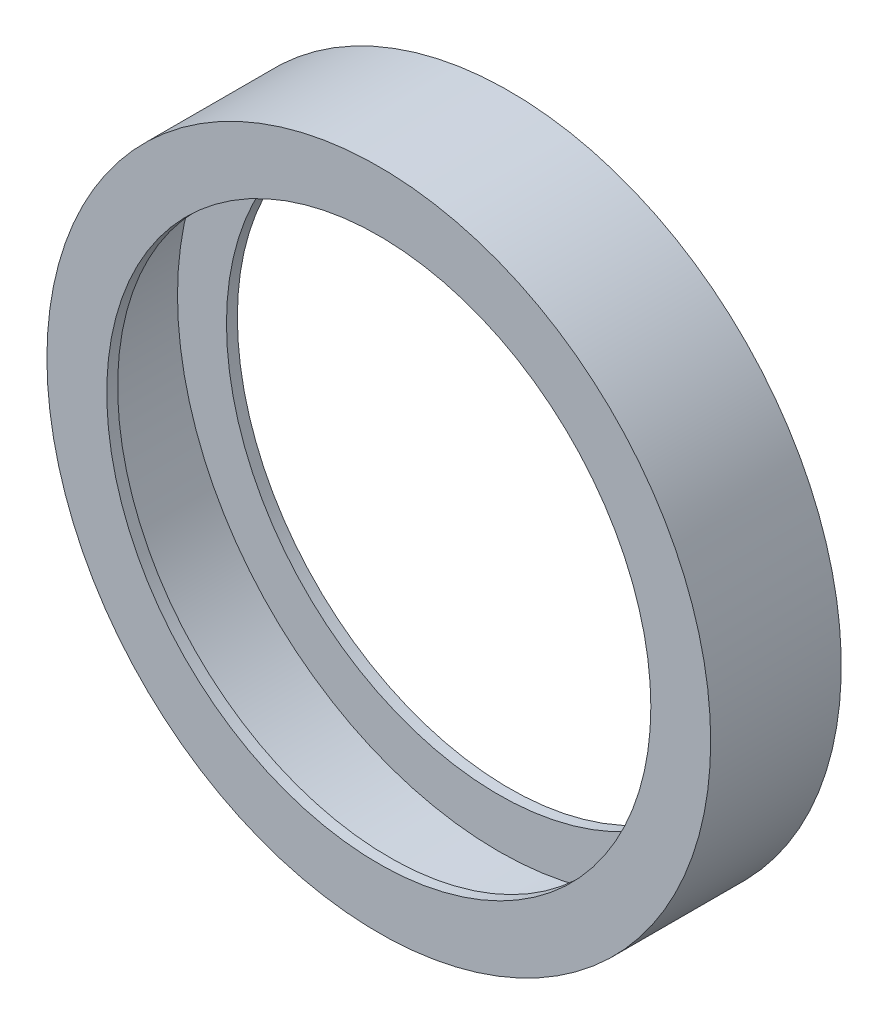
ISO-10303-21;
HEADER;
FILE_DESCRIPTION(('STEP AP214'),'2;1');
FILE_NAME('part.step','',(''),(''),'','','');
FILE_SCHEMA(('AUTOMOTIVE_DESIGN { 1 0 10303 214 1 1 1 1 }'));
ENDSEC;
DATA;
#1=APPLICATION_CONTEXT('core data for automotive mechanical design processes');
#2=APPLICATION_PROTOCOL_DEFINITION('international standard','automotive_design',2000,#1);
#3=PRODUCT_CONTEXT('',#1,'mechanical');
#4=PRODUCT('Part','Part','',(#3));
#5=PRODUCT_RELATED_PRODUCT_CATEGORY('part','',(#4));
#6=PRODUCT_DEFINITION_FORMATION('','',#4);
#7=PRODUCT_DEFINITION_CONTEXT('part definition',#1,'design');
#8=PRODUCT_DEFINITION('design','',#6,#7);
#9=PRODUCT_DEFINITION_SHAPE('','',#8);
#10=(LENGTH_UNIT() NAMED_UNIT(*) SI_UNIT(.MILLI.,.METRE.));
#11=(NAMED_UNIT(*) PLANE_ANGLE_UNIT() SI_UNIT($,.RADIAN.));
#12=(NAMED_UNIT(*) SI_UNIT($,.STERADIAN.) SOLID_ANGLE_UNIT());
#13=UNCERTAINTY_MEASURE_WITH_UNIT(LENGTH_MEASURE(1.E-05),#10,'distance_accuracy_value','');
#14=(GEOMETRIC_REPRESENTATION_CONTEXT(3) GLOBAL_UNCERTAINTY_ASSIGNED_CONTEXT((#13)) GLOBAL_UNIT_ASSIGNED_CONTEXT((#10,
#11,#12)) REPRESENTATION_CONTEXT('',''));
#15=CARTESIAN_POINT('',(0.,0.,0.));
#16=DIRECTION('',(0.,0.,1.));
#17=DIRECTION('',(1.,0.,0.));
#18=AXIS2_PLACEMENT_3D('',#15,#16,#17);
#19=CARTESIAN_POINT('',(0.,0.,0.));
#20=DIRECTION('',(0.,0.,1.));
#21=DIRECTION('',(1.,0.,0.));
#22=AXIS2_PLACEMENT_3D('',#19,#20,#21);
#23=PLANE('',#22);
#24=CARTESIAN_POINT('',(0.,0.,0.));
#25=DIRECTION('',(0.,0.,1.));
#26=DIRECTION('',(1.,0.,0.));
#27=AXIS2_PLACEMENT_3D('',#24,#25,#26);
#28=CIRCLE('',#27,25.);
#29=CARTESIAN_POINT('',(25.,0.,0.));
#30=VERTEX_POINT('',#29);
#31=EDGE_CURVE('E42',#30,#30,#28,.T.);
#32=ORIENTED_EDGE('',*,*,#31,.T.);
#33=EDGE_LOOP('',(#32));
#34=FACE_BOUND('',#33,.T.);
#35=CARTESIAN_POINT('',(0.,0.,0.));
#36=DIRECTION('',(0.,0.,-1.));
#37=DIRECTION('',(-1.,0.,0.));
#38=AXIS2_PLACEMENT_3D('',#35,#36,#37);
#39=CIRCLE('',#38,29.5);
#40=CARTESIAN_POINT('',(-29.5,0.,0.));
#41=VERTEX_POINT('',#40);
#42=EDGE_CURVE('E47',#41,#41,#39,.T.);
#43=ORIENTED_EDGE('',*,*,#42,.T.);
#44=EDGE_LOOP('',(#43));
#45=FACE_BOUND('',#44,.T.);
#46=ADVANCED_FACE('F31',(#34,#45),#23,.F.);
#47=CARTESIAN_POINT('',(0.,0.,1.));
#48=DIRECTION('',(0.,0.,1.));
#49=DIRECTION('',(1.,0.,0.));
#50=AXIS2_PLACEMENT_3D('',#47,#48,#49);
#51=PLANE('',#50);
#52=CARTESIAN_POINT('',(0.,0.,1.));
#53=DIRECTION('',(0.,0.,1.));
#54=DIRECTION('',(1.,0.,0.));
#55=AXIS2_PLACEMENT_3D('',#52,#53,#54);
#56=CIRCLE('',#55,30.5);
#57=CARTESIAN_POINT('',(30.5,0.,1.));
#58=VERTEX_POINT('',#57);
#59=EDGE_CURVE('E10',#58,#58,#56,.T.);
#60=ORIENTED_EDGE('',*,*,#59,.T.);
#61=EDGE_LOOP('',(#60));
#62=FACE_BOUND('',#61,.T.);
#63=CARTESIAN_POINT('',(0.,0.,1.));
#64=DIRECTION('',(0.,0.,1.));
#65=DIRECTION('',(1.,0.,0.));
#66=AXIS2_PLACEMENT_3D('',#63,#64,#65);
#67=CIRCLE('',#66,25.);
#68=CARTESIAN_POINT('',(25.,0.,1.));
#69=VERTEX_POINT('',#68);
#70=EDGE_CURVE('E38',#69,#69,#67,.T.);
#71=ORIENTED_EDGE('',*,*,#70,.F.);
#72=EDGE_LOOP('',(#71));
#73=FACE_BOUND('',#72,.T.);
#74=ADVANCED_FACE('F81',(#62,#73),#51,.T.);
#75=CARTESIAN_POINT('',(0.,0.,1.));
#76=DIRECTION('',(0.,0.,-1.));
#77=DIRECTION('',(-1.,0.,0.));
#78=AXIS2_PLACEMENT_3D('',#75,#76,#77);
#79=CYLINDRICAL_SURFACE('',#78,30.5);
#80=ORIENTED_EDGE('',*,*,#59,.F.);
#81=EDGE_LOOP('',(#80));
#82=FACE_BOUND('',#81,.T.);
#83=CARTESIAN_POINT('',(0.,0.,-11.));
#84=DIRECTION('',(0.,0.,-1.));
#85=DIRECTION('',(-1.,0.,0.));
#86=AXIS2_PLACEMENT_3D('',#83,#84,#85);
#87=CIRCLE('',#86,30.5);
#88=CARTESIAN_POINT('',(-30.5,0.,-11.));
#89=VERTEX_POINT('',#88);
#90=EDGE_CURVE('E54',#89,#89,#87,.T.);
#91=ORIENTED_EDGE('',*,*,#90,.F.);
#92=EDGE_LOOP('',(#91));
#93=FACE_BOUND('',#92,.T.);
#94=ADVANCED_FACE('F33',(#82,#93),#79,.T.);
#95=CARTESIAN_POINT('',(0.,0.,1.));
#96=DIRECTION('',(0.,0.,-1.));
#97=DIRECTION('',(-1.,0.,0.));
#98=AXIS2_PLACEMENT_3D('',#95,#96,#97);
#99=CYLINDRICAL_SURFACE('',#98,25.);
#100=ORIENTED_EDGE('',*,*,#70,.T.);
#101=EDGE_LOOP('',(#100));
#102=FACE_BOUND('',#101,.T.);
#103=ORIENTED_EDGE('',*,*,#31,.F.);
#104=EDGE_LOOP('',(#103));
#105=FACE_BOUND('',#104,.T.);
#106=ADVANCED_FACE('F89',(#102,#105),#99,.F.);
#107=CARTESIAN_POINT('',(0.,0.,-10.));
#108=DIRECTION('',(0.,0.,1.));
#109=DIRECTION('',(1.,0.,0.));
#110=AXIS2_PLACEMENT_3D('',#107,#108,#109);
#111=CYLINDRICAL_SURFACE('',#110,29.5);
#112=CARTESIAN_POINT('',(0.,0.,-10.));
#113=DIRECTION('',(0.,0.,-1.));
#114=DIRECTION('',(-1.,0.,0.));
#115=AXIS2_PLACEMENT_3D('',#112,#113,#114);
#116=CIRCLE('',#115,29.5);
#117=CARTESIAN_POINT('',(-29.5,0.,-10.));
#118=VERTEX_POINT('',#117);
#119=EDGE_CURVE('E51',#118,#118,#116,.T.);
#120=ORIENTED_EDGE('',*,*,#119,.T.);
#121=EDGE_LOOP('',(#120));
#122=FACE_BOUND('',#121,.T.);
#123=ORIENTED_EDGE('',*,*,#42,.F.);
#124=EDGE_LOOP('',(#123));
#125=FACE_BOUND('',#124,.T.);
#126=ADVANCED_FACE('F77',(#122,#125),#111,.F.);
#127=CARTESIAN_POINT('',(0.,0.,-10.));
#128=DIRECTION('',(0.,0.,-1.));
#129=DIRECTION('',(-1.,0.,0.));
#130=AXIS2_PLACEMENT_3D('',#127,#128,#129);
#131=PLANE('',#130);
#132=CARTESIAN_POINT('',(0.,0.,-10.));
#133=DIRECTION('',(0.,0.,-1.));
#134=DIRECTION('',(-1.,0.,0.));
#135=AXIS2_PLACEMENT_3D('',#132,#133,#134);
#136=CIRCLE('',#135,25.);
#137=CARTESIAN_POINT('',(-25.,0.,-10.));
#138=VERTEX_POINT('',#137);
#139=EDGE_CURVE('E58',#138,#138,#136,.T.);
#140=ORIENTED_EDGE('',*,*,#139,.T.);
#141=EDGE_LOOP('',(#140));
#142=FACE_BOUND('',#141,.T.);
#143=ORIENTED_EDGE('',*,*,#119,.F.);
#144=EDGE_LOOP('',(#143));
#145=FACE_BOUND('',#144,.T.);
#146=ADVANCED_FACE('F69',(#142,#145),#131,.F.);
#147=CARTESIAN_POINT('',(0.,0.,-11.));
#148=DIRECTION('',(0.,0.,-1.));
#149=DIRECTION('',(-1.,0.,0.));
#150=AXIS2_PLACEMENT_3D('',#147,#148,#149);
#151=PLANE('',#150);
#152=ORIENTED_EDGE('',*,*,#90,.T.);
#153=EDGE_LOOP('',(#152));
#154=FACE_BOUND('',#153,.T.);
#155=CARTESIAN_POINT('',(0.,0.,-11.));
#156=DIRECTION('',(0.,0.,-1.));
#157=DIRECTION('',(-1.,0.,0.));
#158=AXIS2_PLACEMENT_3D('',#155,#156,#157);
#159=CIRCLE('',#158,25.);
#160=CARTESIAN_POINT('',(-25.,0.,-11.));
#161=VERTEX_POINT('',#160);
#162=EDGE_CURVE('E57',#161,#161,#159,.T.);
#163=ORIENTED_EDGE('',*,*,#162,.F.);
#164=EDGE_LOOP('',(#163));
#165=FACE_BOUND('',#164,.T.);
#166=ADVANCED_FACE('F67',(#154,#165),#151,.T.);
#167=CARTESIAN_POINT('',(0.,0.,-11.));
#168=DIRECTION('',(0.,0.,1.));
#169=DIRECTION('',(1.,0.,0.));
#170=AXIS2_PLACEMENT_3D('',#167,#168,#169);
#171=CYLINDRICAL_SURFACE('',#170,25.);
#172=ORIENTED_EDGE('',*,*,#162,.T.);
#173=EDGE_LOOP('',(#172));
#174=FACE_BOUND('',#173,.T.);
#175=ORIENTED_EDGE('',*,*,#139,.F.);
#176=EDGE_LOOP('',(#175));
#177=FACE_BOUND('',#176,.T.);
#178=ADVANCED_FACE('F64',(#174,#177),#171,.F.);
#179=CLOSED_SHELL('',(#46,#74,#94,#106,#126,#146,#166,#178));
#180=MANIFOLD_SOLID_BREP('B2',#179);
#181=ADVANCED_BREP_SHAPE_REPRESENTATION('',(#18,#180),#14);
#182=SHAPE_DEFINITION_REPRESENTATION(#9,#181);
ENDSEC;
END-ISO-10303-21;
